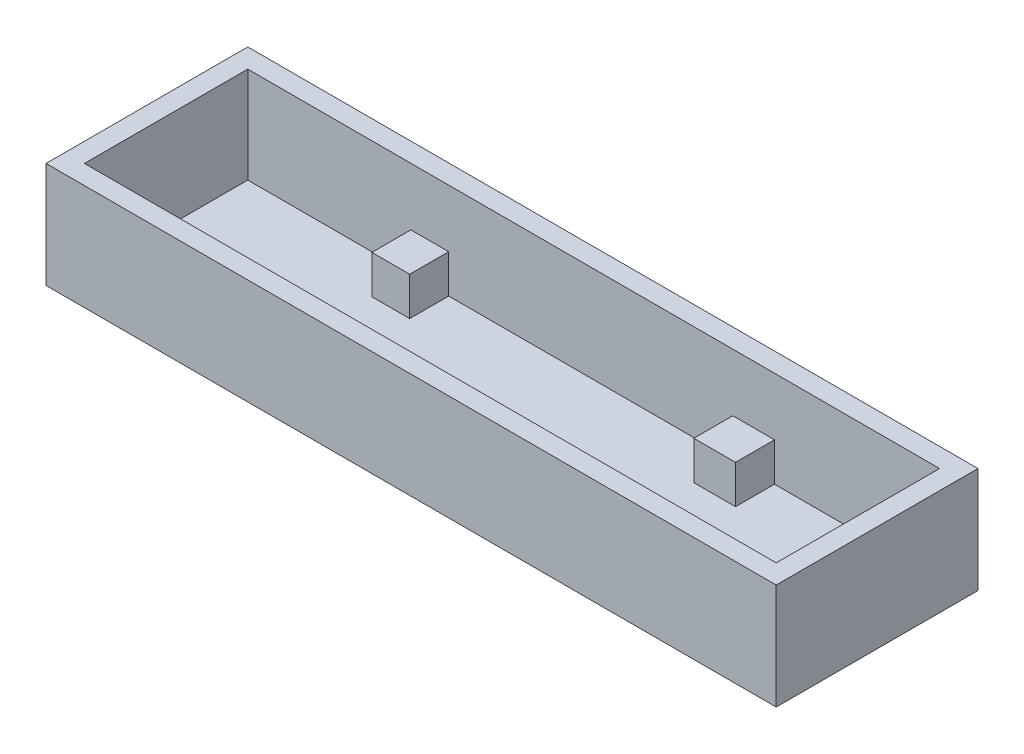
ISO-10303-21;
HEADER;
FILE_DESCRIPTION(('STEP AP214'),'2;1');
FILE_NAME('part.step','',(''),(''),'','','');
FILE_SCHEMA(('AUTOMOTIVE_DESIGN { 1 0 10303 214 1 1 1 1 }'));
ENDSEC;
DATA;
#1=APPLICATION_CONTEXT('core data for automotive mechanical design processes');
#2=APPLICATION_PROTOCOL_DEFINITION('international standard','automotive_design',2000,#1);
#3=PRODUCT_CONTEXT('',#1,'mechanical');
#4=PRODUCT('Part','Part','',(#3));
#5=PRODUCT_RELATED_PRODUCT_CATEGORY('part','',(#4));
#6=PRODUCT_DEFINITION_FORMATION('','',#4);
#7=PRODUCT_DEFINITION_CONTEXT('part definition',#1,'design');
#8=PRODUCT_DEFINITION('design','',#6,#7);
#9=PRODUCT_DEFINITION_SHAPE('','',#8);
#10=(LENGTH_UNIT() NAMED_UNIT(*) SI_UNIT(.MILLI.,.METRE.));
#11=(NAMED_UNIT(*) PLANE_ANGLE_UNIT() SI_UNIT($,.RADIAN.));
#12=(NAMED_UNIT(*) SI_UNIT($,.STERADIAN.) SOLID_ANGLE_UNIT());
#13=UNCERTAINTY_MEASURE_WITH_UNIT(LENGTH_MEASURE(1.E-05),#10,'distance_accuracy_value','');
#14=(GEOMETRIC_REPRESENTATION_CONTEXT(3) GLOBAL_UNCERTAINTY_ASSIGNED_CONTEXT((#13)) GLOBAL_UNIT_ASSIGNED_CONTEXT((#10,
#11,#12)) REPRESENTATION_CONTEXT('',''));
#15=CARTESIAN_POINT('',(0.,0.,0.));
#16=DIRECTION('',(0.,0.,1.));
#17=DIRECTION('',(1.,0.,0.));
#18=AXIS2_PLACEMENT_3D('',#15,#16,#17);
#19=CARTESIAN_POINT('',(0.,0.,0.));
#20=DIRECTION('',(0.,-1.,0.));
#21=DIRECTION('',(0.,0.,-1.));
#22=AXIS2_PLACEMENT_3D('',#19,#20,#21);
#23=PLANE('',#22);
#24=DIRECTION('',(0.,0.,-1.));
#25=VECTOR('',#24,1.);
#26=CARTESIAN_POINT('',(64.,0.,0.));
#27=LINE('',#26,#25);
#28=CARTESIAN_POINT('',(64.,0.,0.));
#29=VERTEX_POINT('',#28);
#30=CARTESIAN_POINT('',(64.,0.,-5.));
#31=VERTEX_POINT('',#30);
#32=EDGE_CURVE('E216',#29,#31,#27,.T.);
#33=ORIENTED_EDGE('',*,*,#32,.F.);
#34=DIRECTION('',(1.,0.,0.));
#35=VECTOR('',#34,1.);
#36=CARTESIAN_POINT('',(0.,0.,0.));
#37=LINE('',#36,#35);
#38=CARTESIAN_POINT('',(72.,0.,0.));
#39=VERTEX_POINT('',#38);
#40=EDGE_CURVE('E350',#29,#39,#37,.T.);
#41=ORIENTED_EDGE('',*,*,#40,.T.);
#42=DIRECTION('',(0.,0.,-1.));
#43=VECTOR('',#42,1.);
#44=CARTESIAN_POINT('',(72.,0.,0.));
#45=LINE('',#44,#43);
#46=CARTESIAN_POINT('',(72.,0.,-17.));
#47=VERTEX_POINT('',#46);
#48=EDGE_CURVE('E324',#39,#47,#45,.T.);
#49=ORIENTED_EDGE('',*,*,#48,.T.);
#50=DIRECTION('',(1.,0.,0.));
#51=VECTOR('',#50,1.);
#52=CARTESIAN_POINT('',(0.,0.,-17.));
#53=LINE('',#52,#51);
#54=CARTESIAN_POINT('',(54.823103669872,0.,-17.));
#55=VERTEX_POINT('',#54);
#56=EDGE_CURVE('E358',#55,#47,#53,.T.);
#57=ORIENTED_EDGE('',*,*,#56,.F.);
#58=DIRECTION('',(0.,0.,-1.));
#59=VECTOR('',#58,1.);
#60=CARTESIAN_POINT('',(54.823103669872,0.,-17.));
#61=LINE('',#60,#59);
#62=CARTESIAN_POINT('',(54.823103669872,0.,-12.9408394717126));
#63=VERTEX_POINT('',#62);
#64=EDGE_CURVE('E253',#63,#55,#61,.T.);
#65=ORIENTED_EDGE('',*,*,#64,.F.);
#66=DIRECTION('',(1.,0.,0.));
#67=VECTOR('',#66,1.);
#68=CARTESIAN_POINT('',(50.4831923679713,0.,-12.9408394717126));
#69=LINE('',#68,#67);
#70=CARTESIAN_POINT('',(50.4831923679713,0.,-12.9408394717126));
#71=VERTEX_POINT('',#70);
#72=EDGE_CURVE('E264',#71,#63,#69,.T.);
#73=ORIENTED_EDGE('',*,*,#72,.F.);
#74=DIRECTION('',(0.,0.,1.));
#75=VECTOR('',#74,1.);
#76=CARTESIAN_POINT('',(50.4831923679713,0.,-17.));
#77=LINE('',#76,#75);
#78=CARTESIAN_POINT('',(50.4831923679713,0.,-17.));
#79=VERTEX_POINT('',#78);
#80=EDGE_CURVE('E248',#79,#71,#77,.T.);
#81=ORIENTED_EDGE('',*,*,#80,.F.);
#82=CARTESIAN_POINT('',(20.911238613159,0.,-17.));
#83=VERTEX_POINT('',#82);
#84=EDGE_CURVE('E361',#83,#79,#53,.T.);
#85=ORIENTED_EDGE('',*,*,#84,.F.);
#86=DIRECTION('',(0.,0.,-1.));
#87=VECTOR('',#86,1.);
#88=CARTESIAN_POINT('',(20.911238613159,0.,-17.));
#89=LINE('',#88,#87);
#90=CARTESIAN_POINT('',(20.911238613159,0.,-12.9408394717126));
#91=VERTEX_POINT('',#90);
#92=EDGE_CURVE('E285',#91,#83,#89,.T.);
#93=ORIENTED_EDGE('',*,*,#92,.F.);
#94=DIRECTION('',(1.,0.,0.));
#95=VECTOR('',#94,1.);
#96=CARTESIAN_POINT('',(16.9750399905048,0.,-12.9408394717126));
#97=LINE('',#96,#95);
#98=CARTESIAN_POINT('',(16.9750399905048,0.,-12.9408394717126));
#99=VERTEX_POINT('',#98);
#100=EDGE_CURVE('E296',#99,#91,#97,.T.);
#101=ORIENTED_EDGE('',*,*,#100,.F.);
#102=DIRECTION('',(0.,0.,1.));
#103=VECTOR('',#102,1.);
#104=CARTESIAN_POINT('',(16.9750399905048,0.,-17.));
#105=LINE('',#104,#103);
#106=CARTESIAN_POINT('',(16.9750399905048,0.,-17.));
#107=VERTEX_POINT('',#106);
#108=EDGE_CURVE('E280',#107,#99,#105,.T.);
#109=ORIENTED_EDGE('',*,*,#108,.F.);
#110=CARTESIAN_POINT('',(0.,0.,-17.));
#111=VERTEX_POINT('',#110);
#112=EDGE_CURVE('E329',#111,#107,#53,.T.);
#113=ORIENTED_EDGE('',*,*,#112,.F.);
#114=DIRECTION('',(0.,0.,-1.));
#115=VECTOR('',#114,1.);
#116=CARTESIAN_POINT('',(0.,0.,0.));
#117=LINE('',#116,#115);
#118=CARTESIAN_POINT('',(0.,0.,0.));
#119=VERTEX_POINT('',#118);
#120=EDGE_CURVE('E354',#119,#111,#117,.T.);
#121=ORIENTED_EDGE('',*,*,#120,.F.);
#122=CARTESIAN_POINT('',(13.,0.,0.));
#123=VERTEX_POINT('',#122);
#124=EDGE_CURVE('E351',#119,#123,#37,.T.);
#125=ORIENTED_EDGE('',*,*,#124,.T.);
#126=DIRECTION('',(0.,0.,1.));
#127=VECTOR('',#126,1.);
#128=CARTESIAN_POINT('',(13.,0.,0.));
#129=LINE('',#128,#127);
#130=CARTESIAN_POINT('',(13.,0.,-5.));
#131=VERTEX_POINT('',#130);
#132=EDGE_CURVE('E217',#131,#123,#129,.T.);
#133=ORIENTED_EDGE('',*,*,#132,.F.);
#134=DIRECTION('',(-1.,0.,0.));
#135=VECTOR('',#134,1.);
#136=CARTESIAN_POINT('',(13.,0.,-5.));
#137=LINE('',#136,#135);
#138=CARTESIAN_POINT('',(18.,0.,-5.));
#139=VERTEX_POINT('',#138);
#140=EDGE_CURVE('E229',#139,#131,#137,.T.);
#141=ORIENTED_EDGE('',*,*,#140,.F.);
#142=DIRECTION('',(0.,0.,-1.));
#143=VECTOR('',#142,1.);
#144=CARTESIAN_POINT('',(18.,0.,0.));
#145=LINE('',#144,#143);
#146=CARTESIAN_POINT('',(18.,0.,0.));
#147=VERTEX_POINT('',#146);
#148=EDGE_CURVE('E219',#147,#139,#145,.T.);
#149=ORIENTED_EDGE('',*,*,#148,.F.);
#150=CARTESIAN_POINT('',(59.,0.,0.));
#151=VERTEX_POINT('',#150);
#152=EDGE_CURVE('E355',#147,#151,#37,.T.);
#153=ORIENTED_EDGE('',*,*,#152,.T.);
#154=DIRECTION('',(0.,0.,1.));
#155=VECTOR('',#154,1.);
#156=CARTESIAN_POINT('',(59.,0.,0.));
#157=LINE('',#156,#155);
#158=CARTESIAN_POINT('',(59.,0.,-5.));
#159=VERTEX_POINT('',#158);
#160=EDGE_CURVE('E55',#159,#151,#157,.T.);
#161=ORIENTED_EDGE('',*,*,#160,.F.);
#162=DIRECTION('',(-1.,0.,0.));
#163=VECTOR('',#162,1.);
#164=CARTESIAN_POINT('',(64.,0.,-5.));
#165=LINE('',#164,#163);
#166=EDGE_CURVE('E50',#31,#159,#165,.T.);
#167=ORIENTED_EDGE('',*,*,#166,.F.);
#168=EDGE_LOOP('',(#33,#41,#49,#57,#65,#73,#81,#85,#93,#101,#109,#113,#121,#125,#133,#141,#149,
#153,#161,#167));
#169=FACE_BOUND('',#168,.T.);
#170=ADVANCED_FACE('F33',(#169),#23,.F.);
#171=CARTESIAN_POINT('',(0.,10.,0.));
#172=DIRECTION('',(0.,0.,-1.));
#173=DIRECTION('',(-1.,0.,0.));
#174=AXIS2_PLACEMENT_3D('',#171,#172,#173);
#175=PLANE('',#174);
#176=ORIENTED_EDGE('',*,*,#40,.F.);
#177=DIRECTION('',(0.,-1.,0.));
#178=VECTOR('',#177,1.);
#179=CARTESIAN_POINT('',(64.,4.,0.));
#180=LINE('',#179,#178);
#181=CARTESIAN_POINT('',(64.,4.,0.));
#182=VERTEX_POINT('',#181);
#183=EDGE_CURVE('E424',#182,#29,#180,.T.);
#184=ORIENTED_EDGE('',*,*,#183,.F.);
#185=DIRECTION('',(1.,0.,0.));
#186=VECTOR('',#185,1.);
#187=CARTESIAN_POINT('',(64.,4.,0.));
#188=LINE('',#187,#186);
#189=CARTESIAN_POINT('',(59.,4.,0.));
#190=VERTEX_POINT('',#189);
#191=EDGE_CURVE('E211',#190,#182,#188,.T.);
#192=ORIENTED_EDGE('',*,*,#191,.F.);
#193=DIRECTION('',(0.,-1.,0.));
#194=VECTOR('',#193,1.);
#195=CARTESIAN_POINT('',(59.,4.,0.));
#196=LINE('',#195,#194);
#197=EDGE_CURVE('E221',#190,#151,#196,.T.);
#198=ORIENTED_EDGE('',*,*,#197,.T.);
#199=ORIENTED_EDGE('',*,*,#152,.F.);
#200=DIRECTION('',(0.,-1.,0.));
#201=VECTOR('',#200,1.);
#202=CARTESIAN_POINT('',(18.,4.,0.));
#203=LINE('',#202,#201);
#204=CARTESIAN_POINT('',(18.,4.,0.));
#205=VERTEX_POINT('',#204);
#206=EDGE_CURVE('E243',#205,#147,#203,.T.);
#207=ORIENTED_EDGE('',*,*,#206,.F.);
#208=DIRECTION('',(1.,0.,0.));
#209=VECTOR('',#208,1.);
#210=CARTESIAN_POINT('',(13.,4.,0.));
#211=LINE('',#210,#209);
#212=CARTESIAN_POINT('',(13.,4.,0.));
#213=VERTEX_POINT('',#212);
#214=EDGE_CURVE('E228',#213,#205,#211,.T.);
#215=ORIENTED_EDGE('',*,*,#214,.F.);
#216=DIRECTION('',(0.,-1.,0.));
#217=VECTOR('',#216,1.);
#218=CARTESIAN_POINT('',(13.,4.,0.));
#219=LINE('',#218,#217);
#220=EDGE_CURVE('E245',#213,#123,#219,.T.);
#221=ORIENTED_EDGE('',*,*,#220,.T.);
#222=ORIENTED_EDGE('',*,*,#124,.F.);
#223=DIRECTION('',(0.,-1.,0.));
#224=VECTOR('',#223,1.);
#225=CARTESIAN_POINT('',(0.,10.,0.));
#226=LINE('',#225,#224);
#227=CARTESIAN_POINT('',(0.,10.,0.));
#228=VERTEX_POINT('',#227);
#229=EDGE_CURVE('E42',#228,#119,#226,.T.);
#230=ORIENTED_EDGE('',*,*,#229,.F.);
#231=DIRECTION('',(1.,0.,0.));
#232=VECTOR('',#231,1.);
#233=CARTESIAN_POINT('',(0.,10.,0.));
#234=LINE('',#233,#232);
#235=CARTESIAN_POINT('',(72.,10.,0.));
#236=VERTEX_POINT('',#235);
#237=EDGE_CURVE('E339',#228,#236,#234,.T.);
#238=ORIENTED_EDGE('',*,*,#237,.T.);
#239=DIRECTION('',(0.,-1.,0.));
#240=VECTOR('',#239,1.);
#241=CARTESIAN_POINT('',(72.,10.,0.));
#242=LINE('',#241,#240);
#243=EDGE_CURVE('E11',#236,#39,#242,.T.);
#244=ORIENTED_EDGE('',*,*,#243,.T.);
#245=EDGE_LOOP('',(#176,#184,#192,#198,#199,#207,#215,#221,#222,#230,#238,#244));
#246=FACE_BOUND('',#245,.T.);
#247=ADVANCED_FACE('F401',(#246),#175,.T.);
#248=CARTESIAN_POINT('',(0.,10.,-17.));
#249=DIRECTION('',(0.,0.,-1.));
#250=DIRECTION('',(-1.,0.,0.));
#251=AXIS2_PLACEMENT_3D('',#248,#249,#250);
#252=PLANE('',#251);
#253=DIRECTION('',(0.,-1.,0.));
#254=VECTOR('',#253,1.);
#255=CARTESIAN_POINT('',(50.4831923679713,4.,-17.));
#256=LINE('',#255,#254);
#257=CARTESIAN_POINT('',(50.4831923679713,4.,-17.));
#258=VERTEX_POINT('',#257);
#259=EDGE_CURVE('E261',#258,#79,#256,.T.);
#260=ORIENTED_EDGE('',*,*,#259,.F.);
#261=DIRECTION('',(-1.,0.,0.));
#262=VECTOR('',#261,1.);
#263=CARTESIAN_POINT('',(50.4831923679713,4.,-17.));
#264=LINE('',#263,#262);
#265=CARTESIAN_POINT('',(54.823103669872,4.,-17.));
#266=VERTEX_POINT('',#265);
#267=EDGE_CURVE('E258',#266,#258,#264,.T.);
#268=ORIENTED_EDGE('',*,*,#267,.F.);
#269=DIRECTION('',(0.,-1.,0.));
#270=VECTOR('',#269,1.);
#271=CARTESIAN_POINT('',(54.823103669872,4.,-17.));
#272=LINE('',#271,#270);
#273=EDGE_CURVE('E271',#266,#55,#272,.T.);
#274=ORIENTED_EDGE('',*,*,#273,.T.);
#275=ORIENTED_EDGE('',*,*,#56,.T.);
#276=DIRECTION('',(0.,-1.,0.));
#277=VECTOR('',#276,1.);
#278=CARTESIAN_POINT('',(72.,10.,-17.));
#279=LINE('',#278,#277);
#280=CARTESIAN_POINT('',(72.,10.,-17.));
#281=VERTEX_POINT('',#280);
#282=EDGE_CURVE('E362',#281,#47,#279,.T.);
#283=ORIENTED_EDGE('',*,*,#282,.F.);
#284=DIRECTION('',(1.,0.,0.));
#285=VECTOR('',#284,1.);
#286=CARTESIAN_POINT('',(0.,10.,-17.));
#287=LINE('',#286,#285);
#288=CARTESIAN_POINT('',(0.,10.,-17.));
#289=VERTEX_POINT('',#288);
#290=EDGE_CURVE('E345',#289,#281,#287,.T.);
#291=ORIENTED_EDGE('',*,*,#290,.F.);
#292=DIRECTION('',(0.,-1.,0.));
#293=VECTOR('',#292,1.);
#294=CARTESIAN_POINT('',(0.,10.,-17.));
#295=LINE('',#294,#293);
#296=EDGE_CURVE('E365',#289,#111,#295,.T.);
#297=ORIENTED_EDGE('',*,*,#296,.T.);
#298=ORIENTED_EDGE('',*,*,#112,.T.);
#299=DIRECTION('',(0.,-1.,0.));
#300=VECTOR('',#299,1.);
#301=CARTESIAN_POINT('',(16.9750399905048,4.,-17.));
#302=LINE('',#301,#300);
#303=CARTESIAN_POINT('',(16.9750399905048,4.,-17.));
#304=VERTEX_POINT('',#303);
#305=EDGE_CURVE('E293',#304,#107,#302,.T.);
#306=ORIENTED_EDGE('',*,*,#305,.F.);
#307=DIRECTION('',(-1.,0.,0.));
#308=VECTOR('',#307,1.);
#309=CARTESIAN_POINT('',(16.9750399905048,4.,-17.));
#310=LINE('',#309,#308);
#311=CARTESIAN_POINT('',(20.911238613159,4.,-17.));
#312=VERTEX_POINT('',#311);
#313=EDGE_CURVE('E290',#312,#304,#310,.T.);
#314=ORIENTED_EDGE('',*,*,#313,.F.);
#315=DIRECTION('',(0.,-1.,0.));
#316=VECTOR('',#315,1.);
#317=CARTESIAN_POINT('',(20.911238613159,4.,-17.));
#318=LINE('',#317,#316);
#319=EDGE_CURVE('E303',#312,#83,#318,.T.);
#320=ORIENTED_EDGE('',*,*,#319,.T.);
#321=ORIENTED_EDGE('',*,*,#84,.T.);
#322=EDGE_LOOP('',(#260,#268,#274,#275,#283,#291,#297,#298,#306,#314,#320,#321));
#323=FACE_BOUND('',#322,.T.);
#324=ADVANCED_FACE('F410',(#323),#252,.F.);
#325=CARTESIAN_POINT('',(72.,10.,0.));
#326=DIRECTION('',(-1.,0.,0.));
#327=DIRECTION('',(0.,0.,1.));
#328=AXIS2_PLACEMENT_3D('',#325,#326,#327);
#329=PLANE('',#328);
#330=ORIENTED_EDGE('',*,*,#48,.F.);
#331=ORIENTED_EDGE('',*,*,#243,.F.);
#332=DIRECTION('',(0.,0.,-1.));
#333=VECTOR('',#332,1.);
#334=CARTESIAN_POINT('',(72.,10.,0.));
#335=LINE('',#334,#333);
#336=EDGE_CURVE('E336',#236,#281,#335,.T.);
#337=ORIENTED_EDGE('',*,*,#336,.T.);
#338=ORIENTED_EDGE('',*,*,#282,.T.);
#339=EDGE_LOOP('',(#330,#331,#337,#338));
#340=FACE_BOUND('',#339,.T.);
#341=ADVANCED_FACE('F412',(#340),#329,.T.);
#342=CARTESIAN_POINT('',(0.,10.,0.));
#343=DIRECTION('',(-1.,0.,0.));
#344=DIRECTION('',(0.,0.,1.));
#345=AXIS2_PLACEMENT_3D('',#342,#343,#344);
#346=PLANE('',#345);
#347=ORIENTED_EDGE('',*,*,#120,.T.);
#348=ORIENTED_EDGE('',*,*,#296,.F.);
#349=DIRECTION('',(0.,0.,-1.));
#350=VECTOR('',#349,1.);
#351=CARTESIAN_POINT('',(0.,10.,0.));
#352=LINE('',#351,#350);
#353=EDGE_CURVE('E342',#228,#289,#352,.T.);
#354=ORIENTED_EDGE('',*,*,#353,.F.);
#355=ORIENTED_EDGE('',*,*,#229,.T.);
#356=EDGE_LOOP('',(#347,#348,#354,#355));
#357=FACE_BOUND('',#356,.T.);
#358=ADVANCED_FACE('F407',(#357),#346,.F.);
#359=CARTESIAN_POINT('',(-2.,10.,0.));
#360=DIRECTION('',(-1.,0.,0.));
#361=DIRECTION('',(0.,0.,1.));
#362=AXIS2_PLACEMENT_3D('',#359,#360,#361);
#363=PLANE('',#362);
#364=DIRECTION('',(0.,-1.,0.));
#365=VECTOR('',#364,1.);
#366=CARTESIAN_POINT('',(-2.,10.,-19.));
#367=LINE('',#366,#365);
#368=CARTESIAN_POINT('',(-2.,10.,-19.));
#369=VERTEX_POINT('',#368);
#370=CARTESIAN_POINT('',(-2.,-1.,-19.));
#371=VERTEX_POINT('',#370);
#372=EDGE_CURVE('E347',#369,#371,#367,.T.);
#373=ORIENTED_EDGE('',*,*,#372,.T.);
#374=DIRECTION('',(0.,0.,-1.));
#375=VECTOR('',#374,1.);
#376=CARTESIAN_POINT('',(-2.,-1.,2.));
#377=LINE('',#376,#375);
#378=CARTESIAN_POINT('',(-2.,-1.,2.));
#379=VERTEX_POINT('',#378);
#380=EDGE_CURVE('E315',#379,#371,#377,.T.);
#381=ORIENTED_EDGE('',*,*,#380,.F.);
#382=DIRECTION('',(0.,-1.,0.));
#383=VECTOR('',#382,1.);
#384=CARTESIAN_POINT('',(-2.,10.,2.));
#385=LINE('',#384,#383);
#386=CARTESIAN_POINT('',(-2.,10.,2.));
#387=VERTEX_POINT('',#386);
#388=EDGE_CURVE('E37',#387,#379,#385,.T.);
#389=ORIENTED_EDGE('',*,*,#388,.F.);
#390=DIRECTION('',(0.,0.,-1.));
#391=VECTOR('',#390,1.);
#392=CARTESIAN_POINT('',(-2.,10.,0.));
#393=LINE('',#392,#391);
#394=EDGE_CURVE('E325',#387,#369,#393,.T.);
#395=ORIENTED_EDGE('',*,*,#394,.T.);
#396=EDGE_LOOP('',(#373,#381,#389,#395));
#397=FACE_BOUND('',#396,.T.);
#398=ADVANCED_FACE('F35',(#397),#363,.T.);
#399=CARTESIAN_POINT('',(0.,10.,2.));
#400=DIRECTION('',(0.,0.,-1.));
#401=DIRECTION('',(-1.,0.,0.));
#402=AXIS2_PLACEMENT_3D('',#399,#400,#401);
#403=PLANE('',#402);
#404=ORIENTED_EDGE('',*,*,#388,.T.);
#405=DIRECTION('',(-1.,0.,0.));
#406=VECTOR('',#405,1.);
#407=CARTESIAN_POINT('',(74.,-1.,2.));
#408=LINE('',#407,#406);
#409=CARTESIAN_POINT('',(74.,-1.,2.));
#410=VERTEX_POINT('',#409);
#411=EDGE_CURVE('E312',#410,#379,#408,.T.);
#412=ORIENTED_EDGE('',*,*,#411,.F.);
#413=DIRECTION('',(0.,-1.,0.));
#414=VECTOR('',#413,1.);
#415=CARTESIAN_POINT('',(74.,10.,2.));
#416=LINE('',#415,#414);
#417=CARTESIAN_POINT('',(74.,10.,2.));
#418=VERTEX_POINT('',#417);
#419=EDGE_CURVE('E370',#418,#410,#416,.T.);
#420=ORIENTED_EDGE('',*,*,#419,.F.);
#421=DIRECTION('',(1.,0.,0.));
#422=VECTOR('',#421,1.);
#423=CARTESIAN_POINT('',(0.,10.,2.));
#424=LINE('',#423,#422);
#425=EDGE_CURVE('E328',#387,#418,#424,.T.);
#426=ORIENTED_EDGE('',*,*,#425,.F.);
#427=EDGE_LOOP('',(#404,#412,#420,#426));
#428=FACE_BOUND('',#427,.T.);
#429=ADVANCED_FACE('F379',(#428),#403,.F.);
#430=CARTESIAN_POINT('',(74.,10.,0.));
#431=DIRECTION('',(-1.,0.,0.));
#432=DIRECTION('',(0.,0.,1.));
#433=AXIS2_PLACEMENT_3D('',#430,#431,#432);
#434=PLANE('',#433);
#435=ORIENTED_EDGE('',*,*,#419,.T.);
#436=DIRECTION('',(0.,0.,1.));
#437=VECTOR('',#436,1.);
#438=CARTESIAN_POINT('',(74.,-1.,-19.));
#439=LINE('',#438,#437);
#440=CARTESIAN_POINT('',(74.,-1.,-19.));
#441=VERTEX_POINT('',#440);
#442=EDGE_CURVE('E321',#441,#410,#439,.T.);
#443=ORIENTED_EDGE('',*,*,#442,.F.);
#444=DIRECTION('',(0.,-1.,0.));
#445=VECTOR('',#444,1.);
#446=CARTESIAN_POINT('',(74.,10.,-19.));
#447=LINE('',#446,#445);
#448=CARTESIAN_POINT('',(74.,10.,-19.));
#449=VERTEX_POINT('',#448);
#450=EDGE_CURVE('E369',#449,#441,#447,.T.);
#451=ORIENTED_EDGE('',*,*,#450,.F.);
#452=DIRECTION('',(0.,0.,-1.));
#453=VECTOR('',#452,1.);
#454=CARTESIAN_POINT('',(74.,10.,0.));
#455=LINE('',#454,#453);
#456=EDGE_CURVE('E331',#418,#449,#455,.T.);
#457=ORIENTED_EDGE('',*,*,#456,.F.);
#458=EDGE_LOOP('',(#435,#443,#451,#457));
#459=FACE_BOUND('',#458,.T.);
#460=ADVANCED_FACE('F386',(#459),#434,.F.);
#461=CARTESIAN_POINT('',(0.,10.,-19.));
#462=DIRECTION('',(0.,0.,-1.));
#463=DIRECTION('',(-1.,0.,0.));
#464=AXIS2_PLACEMENT_3D('',#461,#462,#463);
#465=PLANE('',#464);
#466=ORIENTED_EDGE('',*,*,#450,.T.);
#467=DIRECTION('',(1.,0.,0.));
#468=VECTOR('',#467,1.);
#469=CARTESIAN_POINT('',(-2.,-1.,-19.));
#470=LINE('',#469,#468);
#471=EDGE_CURVE('E318',#371,#441,#470,.T.);
#472=ORIENTED_EDGE('',*,*,#471,.F.);
#473=ORIENTED_EDGE('',*,*,#372,.F.);
#474=DIRECTION('',(1.,0.,0.));
#475=VECTOR('',#474,1.);
#476=CARTESIAN_POINT('',(0.,10.,-19.));
#477=LINE('',#476,#475);
#478=EDGE_CURVE('E333',#369,#449,#477,.T.);
#479=ORIENTED_EDGE('',*,*,#478,.T.);
#480=EDGE_LOOP('',(#466,#472,#473,#479));
#481=FACE_BOUND('',#480,.T.);
#482=ADVANCED_FACE('F389',(#481),#465,.T.);
#483=CARTESIAN_POINT('',(0.,10.,0.));
#484=DIRECTION('',(0.,1.,0.));
#485=DIRECTION('',(0.,0.,1.));
#486=AXIS2_PLACEMENT_3D('',#483,#484,#485);
#487=PLANE('',#486);
#488=ORIENTED_EDGE('',*,*,#394,.F.);
#489=ORIENTED_EDGE('',*,*,#425,.T.);
#490=ORIENTED_EDGE('',*,*,#456,.T.);
#491=ORIENTED_EDGE('',*,*,#478,.F.);
#492=EDGE_LOOP('',(#488,#489,#490,#491));
#493=FACE_BOUND('',#492,.T.);
#494=ORIENTED_EDGE('',*,*,#336,.F.);
#495=ORIENTED_EDGE('',*,*,#237,.F.);
#496=ORIENTED_EDGE('',*,*,#353,.T.);
#497=ORIENTED_EDGE('',*,*,#290,.T.);
#498=EDGE_LOOP('',(#494,#495,#496,#497));
#499=FACE_BOUND('',#498,.T.);
#500=ADVANCED_FACE('F391',(#493,#499),#487,.T.);
#501=CARTESIAN_POINT('',(0.,-1.,0.));
#502=DIRECTION('',(0.,-1.,0.));
#503=DIRECTION('',(0.,0.,-1.));
#504=AXIS2_PLACEMENT_3D('',#501,#502,#503);
#505=PLANE('',#504);
#506=ORIENTED_EDGE('',*,*,#411,.T.);
#507=ORIENTED_EDGE('',*,*,#380,.T.);
#508=ORIENTED_EDGE('',*,*,#471,.T.);
#509=ORIENTED_EDGE('',*,*,#442,.T.);
#510=EDGE_LOOP('',(#506,#507,#508,#509));
#511=FACE_BOUND('',#510,.T.);
#512=ADVANCED_FACE('F384',(#511),#505,.T.);
#513=CARTESIAN_POINT('',(16.9750399905048,4.,-17.));
#514=DIRECTION('',(1.,0.,0.));
#515=DIRECTION('',(0.,0.,-1.));
#516=AXIS2_PLACEMENT_3D('',#513,#514,#515);
#517=PLANE('',#516);
#518=ORIENTED_EDGE('',*,*,#108,.T.);
#519=DIRECTION('',(0.,-1.,0.));
#520=VECTOR('',#519,1.);
#521=CARTESIAN_POINT('',(16.9750399905048,4.,-12.9408394717126));
#522=LINE('',#521,#520);
#523=CARTESIAN_POINT('',(16.9750399905048,4.,-12.9408394717126));
#524=VERTEX_POINT('',#523);
#525=EDGE_CURVE('E309',#524,#99,#522,.T.);
#526=ORIENTED_EDGE('',*,*,#525,.F.);
#527=DIRECTION('',(0.,0.,1.));
#528=VECTOR('',#527,1.);
#529=CARTESIAN_POINT('',(16.9750399905048,4.,-17.));
#530=LINE('',#529,#528);
#531=EDGE_CURVE('E281',#304,#524,#530,.T.);
#532=ORIENTED_EDGE('',*,*,#531,.F.);
#533=ORIENTED_EDGE('',*,*,#305,.T.);
#534=EDGE_LOOP('',(#518,#526,#532,#533));
#535=FACE_BOUND('',#534,.T.);
#536=ADVANCED_FACE('F577',(#535),#517,.F.);
#537=CARTESIAN_POINT('',(16.9750399905048,4.,-12.9408394717126));
#538=DIRECTION('',(0.,0.,-1.));
#539=DIRECTION('',(-1.,0.,0.));
#540=AXIS2_PLACEMENT_3D('',#537,#538,#539);
#541=PLANE('',#540);
#542=ORIENTED_EDGE('',*,*,#100,.T.);
#543=DIRECTION('',(0.,-1.,0.));
#544=VECTOR('',#543,1.);
#545=CARTESIAN_POINT('',(20.911238613159,4.,-12.9408394717126));
#546=LINE('',#545,#544);
#547=CARTESIAN_POINT('',(20.911238613159,4.,-12.9408394717126));
#548=VERTEX_POINT('',#547);
#549=EDGE_CURVE('E306',#548,#91,#546,.T.);
#550=ORIENTED_EDGE('',*,*,#549,.F.);
#551=DIRECTION('',(1.,0.,0.));
#552=VECTOR('',#551,1.);
#553=CARTESIAN_POINT('',(16.9750399905048,4.,-12.9408394717126));
#554=LINE('',#553,#552);
#555=EDGE_CURVE('E284',#524,#548,#554,.T.);
#556=ORIENTED_EDGE('',*,*,#555,.F.);
#557=ORIENTED_EDGE('',*,*,#525,.T.);
#558=EDGE_LOOP('',(#542,#550,#556,#557));
#559=FACE_BOUND('',#558,.T.);
#560=ADVANCED_FACE('F574',(#559),#541,.F.);
#561=CARTESIAN_POINT('',(20.911238613159,4.,-17.));
#562=DIRECTION('',(-1.,0.,0.));
#563=DIRECTION('',(0.,0.,1.));
#564=AXIS2_PLACEMENT_3D('',#561,#562,#563);
#565=PLANE('',#564);
#566=ORIENTED_EDGE('',*,*,#92,.T.);
#567=ORIENTED_EDGE('',*,*,#319,.F.);
#568=DIRECTION('',(0.,0.,-1.));
#569=VECTOR('',#568,1.);
#570=CARTESIAN_POINT('',(20.911238613159,4.,-17.));
#571=LINE('',#570,#569);
#572=EDGE_CURVE('E287',#548,#312,#571,.T.);
#573=ORIENTED_EDGE('',*,*,#572,.F.);
#574=ORIENTED_EDGE('',*,*,#549,.T.);
#575=EDGE_LOOP('',(#566,#567,#573,#574));
#576=FACE_BOUND('',#575,.T.);
#577=ADVANCED_FACE('F570',(#576),#565,.F.);
#578=CARTESIAN_POINT('',(0.,4.,0.));
#579=DIRECTION('',(0.,1.,0.));
#580=DIRECTION('',(0.,0.,1.));
#581=AXIS2_PLACEMENT_3D('',#578,#579,#580);
#582=PLANE('',#581);
#583=ORIENTED_EDGE('',*,*,#531,.T.);
#584=ORIENTED_EDGE('',*,*,#555,.T.);
#585=ORIENTED_EDGE('',*,*,#572,.T.);
#586=ORIENTED_EDGE('',*,*,#313,.T.);
#587=EDGE_LOOP('',(#583,#584,#585,#586));
#588=FACE_BOUND('',#587,.T.);
#589=ADVANCED_FACE('F566',(#588),#582,.T.);
#590=CARTESIAN_POINT('',(50.4831923679713,4.,-17.));
#591=DIRECTION('',(1.,0.,0.));
#592=DIRECTION('',(0.,0.,-1.));
#593=AXIS2_PLACEMENT_3D('',#590,#591,#592);
#594=PLANE('',#593);
#595=ORIENTED_EDGE('',*,*,#80,.T.);
#596=DIRECTION('',(0.,-1.,0.));
#597=VECTOR('',#596,1.);
#598=CARTESIAN_POINT('',(50.4831923679713,4.,-12.9408394717126));
#599=LINE('',#598,#597);
#600=CARTESIAN_POINT('',(50.4831923679713,4.,-12.9408394717126));
#601=VERTEX_POINT('',#600);
#602=EDGE_CURVE('E277',#601,#71,#599,.T.);
#603=ORIENTED_EDGE('',*,*,#602,.F.);
#604=DIRECTION('',(0.,0.,1.));
#605=VECTOR('',#604,1.);
#606=CARTESIAN_POINT('',(50.4831923679713,4.,-17.));
#607=LINE('',#606,#605);
#608=EDGE_CURVE('E249',#258,#601,#607,.T.);
#609=ORIENTED_EDGE('',*,*,#608,.F.);
#610=ORIENTED_EDGE('',*,*,#259,.T.);
#611=EDGE_LOOP('',(#595,#603,#609,#610));
#612=FACE_BOUND('',#611,.T.);
#613=ADVANCED_FACE('F562',(#612),#594,.F.);
#614=CARTESIAN_POINT('',(50.4831923679713,4.,-12.9408394717126));
#615=DIRECTION('',(0.,0.,-1.));
#616=DIRECTION('',(-1.,0.,0.));
#617=AXIS2_PLACEMENT_3D('',#614,#615,#616);
#618=PLANE('',#617);
#619=ORIENTED_EDGE('',*,*,#72,.T.);
#620=DIRECTION('',(0.,-1.,0.));
#621=VECTOR('',#620,1.);
#622=CARTESIAN_POINT('',(54.823103669872,4.,-12.9408394717126));
#623=LINE('',#622,#621);
#624=CARTESIAN_POINT('',(54.823103669872,4.,-12.9408394717126));
#625=VERTEX_POINT('',#624);
#626=EDGE_CURVE('E274',#625,#63,#623,.T.);
#627=ORIENTED_EDGE('',*,*,#626,.F.);
#628=DIRECTION('',(1.,0.,0.));
#629=VECTOR('',#628,1.);
#630=CARTESIAN_POINT('',(50.4831923679713,4.,-12.9408394717126));
#631=LINE('',#630,#629);
#632=EDGE_CURVE('E252',#601,#625,#631,.T.);
#633=ORIENTED_EDGE('',*,*,#632,.F.);
#634=ORIENTED_EDGE('',*,*,#602,.T.);
#635=EDGE_LOOP('',(#619,#627,#633,#634));
#636=FACE_BOUND('',#635,.T.);
#637=ADVANCED_FACE('F558',(#636),#618,.F.);
#638=CARTESIAN_POINT('',(54.823103669872,4.,-17.));
#639=DIRECTION('',(-1.,0.,0.));
#640=DIRECTION('',(0.,0.,1.));
#641=AXIS2_PLACEMENT_3D('',#638,#639,#640);
#642=PLANE('',#641);
#643=ORIENTED_EDGE('',*,*,#64,.T.);
#644=ORIENTED_EDGE('',*,*,#273,.F.);
#645=DIRECTION('',(0.,0.,-1.));
#646=VECTOR('',#645,1.);
#647=CARTESIAN_POINT('',(54.823103669872,4.,-17.));
#648=LINE('',#647,#646);
#649=EDGE_CURVE('E255',#625,#266,#648,.T.);
#650=ORIENTED_EDGE('',*,*,#649,.F.);
#651=ORIENTED_EDGE('',*,*,#626,.T.);
#652=EDGE_LOOP('',(#643,#644,#650,#651));
#653=FACE_BOUND('',#652,.T.);
#654=ADVANCED_FACE('F554',(#653),#642,.F.);
#655=CARTESIAN_POINT('',(0.,4.,0.));
#656=DIRECTION('',(0.,1.,0.));
#657=DIRECTION('',(0.,0.,1.));
#658=AXIS2_PLACEMENT_3D('',#655,#656,#657);
#659=PLANE('',#658);
#660=ORIENTED_EDGE('',*,*,#608,.T.);
#661=ORIENTED_EDGE('',*,*,#632,.T.);
#662=ORIENTED_EDGE('',*,*,#649,.T.);
#663=ORIENTED_EDGE('',*,*,#267,.T.);
#664=EDGE_LOOP('',(#660,#661,#662,#663));
#665=FACE_BOUND('',#664,.T.);
#666=ADVANCED_FACE('F493',(#665),#659,.T.);
#667=CARTESIAN_POINT('',(13.,4.,0.));
#668=DIRECTION('',(1.,0.,0.));
#669=DIRECTION('',(0.,0.,-1.));
#670=AXIS2_PLACEMENT_3D('',#667,#668,#669);
#671=PLANE('',#670);
#672=ORIENTED_EDGE('',*,*,#132,.T.);
#673=ORIENTED_EDGE('',*,*,#220,.F.);
#674=DIRECTION('',(0.,0.,1.));
#675=VECTOR('',#674,1.);
#676=CARTESIAN_POINT('',(13.,4.,0.));
#677=LINE('',#676,#675);
#678=CARTESIAN_POINT('',(13.,4.,-5.));
#679=VERTEX_POINT('',#678);
#680=EDGE_CURVE('E225',#679,#213,#677,.T.);
#681=ORIENTED_EDGE('',*,*,#680,.F.);
#682=DIRECTION('',(0.,-1.,0.));
#683=VECTOR('',#682,1.);
#684=CARTESIAN_POINT('',(13.,4.,-5.));
#685=LINE('',#684,#683);
#686=EDGE_CURVE('E234',#679,#131,#685,.T.);
#687=ORIENTED_EDGE('',*,*,#686,.T.);
#688=EDGE_LOOP('',(#672,#673,#681,#687));
#689=FACE_BOUND('',#688,.T.);
#690=ADVANCED_FACE('F487',(#689),#671,.F.);
#691=CARTESIAN_POINT('',(18.,4.,0.));
#692=DIRECTION('',(-1.,0.,0.));
#693=DIRECTION('',(0.,0.,1.));
#694=AXIS2_PLACEMENT_3D('',#691,#692,#693);
#695=PLANE('',#694);
#696=ORIENTED_EDGE('',*,*,#148,.T.);
#697=DIRECTION('',(0.,-1.,0.));
#698=VECTOR('',#697,1.);
#699=CARTESIAN_POINT('',(18.,4.,-5.));
#700=LINE('',#699,#698);
#701=CARTESIAN_POINT('',(18.,4.,-5.));
#702=VERTEX_POINT('',#701);
#703=EDGE_CURVE('E240',#702,#139,#700,.T.);
#704=ORIENTED_EDGE('',*,*,#703,.F.);
#705=DIRECTION('',(0.,0.,-1.));
#706=VECTOR('',#705,1.);
#707=CARTESIAN_POINT('',(18.,4.,0.));
#708=LINE('',#707,#706);
#709=EDGE_CURVE('E231',#205,#702,#708,.T.);
#710=ORIENTED_EDGE('',*,*,#709,.F.);
#711=ORIENTED_EDGE('',*,*,#206,.T.);
#712=EDGE_LOOP('',(#696,#704,#710,#711));
#713=FACE_BOUND('',#712,.T.);
#714=ADVANCED_FACE('F492',(#713),#695,.F.);
#715=CARTESIAN_POINT('',(13.,4.,-5.));
#716=DIRECTION('',(0.,0.,1.));
#717=DIRECTION('',(1.,0.,0.));
#718=AXIS2_PLACEMENT_3D('',#715,#716,#717);
#719=PLANE('',#718);
#720=ORIENTED_EDGE('',*,*,#140,.T.);
#721=ORIENTED_EDGE('',*,*,#686,.F.);
#722=DIRECTION('',(-1.,0.,0.));
#723=VECTOR('',#722,1.);
#724=CARTESIAN_POINT('',(13.,4.,-5.));
#725=LINE('',#724,#723);
#726=EDGE_CURVE('E233',#702,#679,#725,.T.);
#727=ORIENTED_EDGE('',*,*,#726,.F.);
#728=ORIENTED_EDGE('',*,*,#703,.T.);
#729=EDGE_LOOP('',(#720,#721,#727,#728));
#730=FACE_BOUND('',#729,.T.);
#731=ADVANCED_FACE('F504',(#730),#719,.F.);
#732=CARTESIAN_POINT('',(0.,4.,0.));
#733=DIRECTION('',(0.,-1.,0.));
#734=DIRECTION('',(0.,0.,-1.));
#735=AXIS2_PLACEMENT_3D('',#732,#733,#734);
#736=PLANE('',#735);
#737=ORIENTED_EDGE('',*,*,#680,.T.);
#738=ORIENTED_EDGE('',*,*,#214,.T.);
#739=ORIENTED_EDGE('',*,*,#709,.T.);
#740=ORIENTED_EDGE('',*,*,#726,.T.);
#741=EDGE_LOOP('',(#737,#738,#739,#740));
#742=FACE_BOUND('',#741,.T.);
#743=ADVANCED_FACE('F514',(#742),#736,.F.);
#744=CARTESIAN_POINT('',(64.,4.,0.));
#745=DIRECTION('',(-1.,0.,0.));
#746=DIRECTION('',(0.,0.,1.));
#747=AXIS2_PLACEMENT_3D('',#744,#745,#746);
#748=PLANE('',#747);
#749=ORIENTED_EDGE('',*,*,#32,.T.);
#750=DIRECTION('',(0.,-1.,0.));
#751=VECTOR('',#750,1.);
#752=CARTESIAN_POINT('',(64.,4.,-5.));
#753=LINE('',#752,#751);
#754=CARTESIAN_POINT('',(64.,4.,-5.));
#755=VERTEX_POINT('',#754);
#756=EDGE_CURVE('E198',#755,#31,#753,.T.);
#757=ORIENTED_EDGE('',*,*,#756,.F.);
#758=DIRECTION('',(0.,0.,-1.));
#759=VECTOR('',#758,1.);
#760=CARTESIAN_POINT('',(64.,4.,0.));
#761=LINE('',#760,#759);
#762=EDGE_CURVE('E206',#182,#755,#761,.T.);
#763=ORIENTED_EDGE('',*,*,#762,.F.);
#764=ORIENTED_EDGE('',*,*,#183,.T.);
#765=EDGE_LOOP('',(#749,#757,#763,#764));
#766=FACE_BOUND('',#765,.T.);
#767=ADVANCED_FACE('F215',(#766),#748,.F.);
#768=CARTESIAN_POINT('',(64.,4.,-5.));
#769=DIRECTION('',(0.,0.,1.));
#770=DIRECTION('',(1.,0.,0.));
#771=AXIS2_PLACEMENT_3D('',#768,#769,#770);
#772=PLANE('',#771);
#773=ORIENTED_EDGE('',*,*,#166,.T.);
#774=DIRECTION('',(0.,-1.,0.));
#775=VECTOR('',#774,1.);
#776=CARTESIAN_POINT('',(59.,4.,-5.));
#777=LINE('',#776,#775);
#778=CARTESIAN_POINT('',(59.,4.,-5.));
#779=VERTEX_POINT('',#778);
#780=EDGE_CURVE('E201',#779,#159,#777,.T.);
#781=ORIENTED_EDGE('',*,*,#780,.F.);
#782=DIRECTION('',(-1.,0.,0.));
#783=VECTOR('',#782,1.);
#784=CARTESIAN_POINT('',(64.,4.,-5.));
#785=LINE('',#784,#783);
#786=EDGE_CURVE('E194',#755,#779,#785,.T.);
#787=ORIENTED_EDGE('',*,*,#786,.F.);
#788=ORIENTED_EDGE('',*,*,#756,.T.);
#789=EDGE_LOOP('',(#773,#781,#787,#788));
#790=FACE_BOUND('',#789,.T.);
#791=ADVANCED_FACE('F196',(#790),#772,.F.);
#792=CARTESIAN_POINT('',(59.,4.,0.));
#793=DIRECTION('',(1.,0.,0.));
#794=DIRECTION('',(0.,0.,-1.));
#795=AXIS2_PLACEMENT_3D('',#792,#793,#794);
#796=PLANE('',#795);
#797=ORIENTED_EDGE('',*,*,#160,.T.);
#798=ORIENTED_EDGE('',*,*,#197,.F.);
#799=DIRECTION('',(0.,0.,1.));
#800=VECTOR('',#799,1.);
#801=CARTESIAN_POINT('',(59.,4.,0.));
#802=LINE('',#801,#800);
#803=EDGE_CURVE('E205',#779,#190,#802,.T.);
#804=ORIENTED_EDGE('',*,*,#803,.F.);
#805=ORIENTED_EDGE('',*,*,#780,.T.);
#806=EDGE_LOOP('',(#797,#798,#804,#805));
#807=FACE_BOUND('',#806,.T.);
#808=ADVANCED_FACE('F419',(#807),#796,.F.);
#809=CARTESIAN_POINT('',(0.,4.,0.));
#810=DIRECTION('',(0.,1.,0.));
#811=DIRECTION('',(0.,0.,1.));
#812=AXIS2_PLACEMENT_3D('',#809,#810,#811);
#813=PLANE('',#812);
#814=ORIENTED_EDGE('',*,*,#762,.T.);
#815=ORIENTED_EDGE('',*,*,#786,.T.);
#816=ORIENTED_EDGE('',*,*,#803,.T.);
#817=ORIENTED_EDGE('',*,*,#191,.T.);
#818=EDGE_LOOP('',(#814,#815,#816,#817));
#819=FACE_BOUND('',#818,.T.);
#820=ADVANCED_FACE('F210',(#819),#813,.T.);
#821=CLOSED_SHELL('',(#170,#247,#324,#341,#358,#398,#429,#460,#482,#500,#512,#536,#560,#577,
#589,#613,#637,#654,#666,#690,#714,#731,#743,#767,#791,#808,#820));
#822=MANIFOLD_SOLID_BREP('B2',#821);
#823=ADVANCED_BREP_SHAPE_REPRESENTATION('',(#18,#822),#14);
#824=SHAPE_DEFINITION_REPRESENTATION(#9,#823);
ENDSEC;
END-ISO-10303-21;
